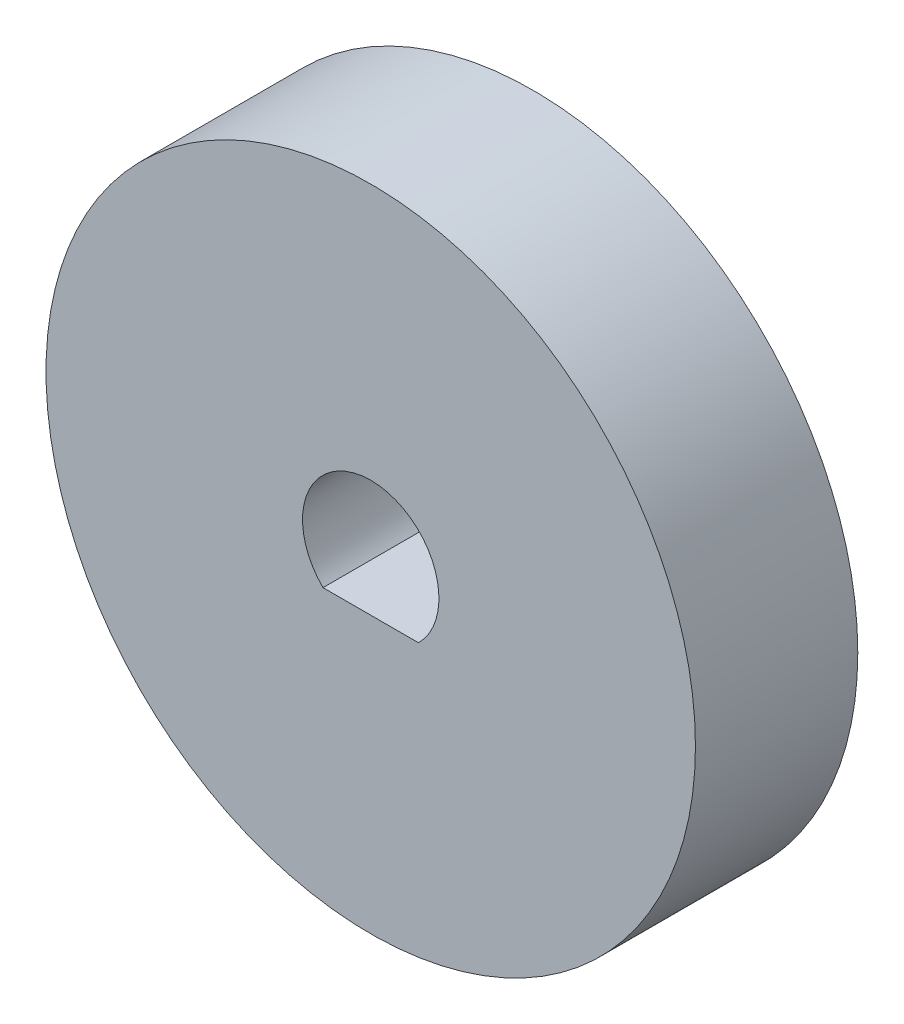
ISO-10303-21;
HEADER;
FILE_DESCRIPTION(('STEP AP214'),'2;1');
FILE_NAME('part.step','',(''),(''),'','','');
FILE_SCHEMA(('AUTOMOTIVE_DESIGN { 1 0 10303 214 1 1 1 1 }'));
ENDSEC;
DATA;
#1=APPLICATION_CONTEXT('core data for automotive mechanical design processes');
#2=APPLICATION_PROTOCOL_DEFINITION('international standard','automotive_design',2000,#1);
#3=PRODUCT_CONTEXT('',#1,'mechanical');
#4=PRODUCT('Part','Part','',(#3));
#5=PRODUCT_RELATED_PRODUCT_CATEGORY('part','',(#4));
#6=PRODUCT_DEFINITION_FORMATION('','',#4);
#7=PRODUCT_DEFINITION_CONTEXT('part definition',#1,'design');
#8=PRODUCT_DEFINITION('design','',#6,#7);
#9=PRODUCT_DEFINITION_SHAPE('','',#8);
#10=(LENGTH_UNIT() NAMED_UNIT(*) SI_UNIT(.MILLI.,.METRE.));
#11=(NAMED_UNIT(*) PLANE_ANGLE_UNIT() SI_UNIT($,.RADIAN.));
#12=(NAMED_UNIT(*) SI_UNIT($,.STERADIAN.) SOLID_ANGLE_UNIT());
#13=UNCERTAINTY_MEASURE_WITH_UNIT(LENGTH_MEASURE(1.E-05),#10,'distance_accuracy_value','');
#14=(GEOMETRIC_REPRESENTATION_CONTEXT(3) GLOBAL_UNCERTAINTY_ASSIGNED_CONTEXT((#13)) GLOBAL_UNIT_ASSIGNED_CONTEXT((#10,
#11,#12)) REPRESENTATION_CONTEXT('',''));
#15=CARTESIAN_POINT('',(0.,0.,0.));
#16=DIRECTION('',(0.,0.,1.));
#17=DIRECTION('',(1.,0.,0.));
#18=AXIS2_PLACEMENT_3D('',#15,#16,#17);
#19=CARTESIAN_POINT('',(0.,0.,5.));
#20=DIRECTION('',(0.,0.,-1.));
#21=DIRECTION('',(-1.,0.,0.));
#22=AXIS2_PLACEMENT_3D('',#19,#20,#21);
#23=CYLINDRICAL_SURFACE('',#22,10.);
#24=CARTESIAN_POINT('',(0.,0.,5.));
#25=DIRECTION('',(0.,0.,1.));
#26=DIRECTION('',(1.,0.,0.));
#27=AXIS2_PLACEMENT_3D('',#24,#25,#26);
#28=CIRCLE('',#27,10.);
#29=CARTESIAN_POINT('',(10.,0.,5.));
#30=VERTEX_POINT('',#29);
#31=EDGE_CURVE('E11',#30,#30,#28,.T.);
#32=ORIENTED_EDGE('',*,*,#31,.F.);
#33=EDGE_LOOP('',(#32));
#34=FACE_BOUND('',#33,.T.);
#35=CARTESIAN_POINT('',(0.,0.,0.));
#36=DIRECTION('',(0.,0.,1.));
#37=DIRECTION('',(1.,0.,0.));
#38=AXIS2_PLACEMENT_3D('',#35,#36,#37);
#39=CIRCLE('',#38,10.);
#40=CARTESIAN_POINT('',(10.,0.,0.));
#41=VERTEX_POINT('',#40);
#42=EDGE_CURVE('E36',#41,#41,#39,.T.);
#43=ORIENTED_EDGE('',*,*,#42,.T.);
#44=EDGE_LOOP('',(#43));
#45=FACE_BOUND('',#44,.T.);
#46=ADVANCED_FACE('F33',(#34,#45),#23,.T.);
#47=CARTESIAN_POINT('',(0.,0.,5.));
#48=DIRECTION('',(0.,0.,1.));
#49=DIRECTION('',(1.,0.,0.));
#50=AXIS2_PLACEMENT_3D('',#47,#48,#49);
#51=PLANE('',#50);
#52=CARTESIAN_POINT('',(0.,0.,5.));
#53=DIRECTION('',(0.,0.,1.));
#54=DIRECTION('',(1.,0.,0.));
#55=AXIS2_PLACEMENT_3D('',#52,#53,#54);
#56=CIRCLE('',#55,2.1);
#57=CARTESIAN_POINT('',(1.46969384566991,-1.5,5.));
#58=VERTEX_POINT('',#57);
#59=CARTESIAN_POINT('',(-1.46969384566991,-1.5,5.));
#60=VERTEX_POINT('',#59);
#61=EDGE_CURVE('E47',#58,#60,#56,.T.);
#62=ORIENTED_EDGE('',*,*,#61,.F.);
#63=DIRECTION('',(1.,0.,0.));
#64=VECTOR('',#63,1.);
#65=CARTESIAN_POINT('',(1.46969384566991,-1.5,5.));
#66=LINE('',#65,#64);
#67=EDGE_CURVE('E66',#60,#58,#66,.T.);
#68=ORIENTED_EDGE('',*,*,#67,.F.);
#69=EDGE_LOOP('',(#62,#68));
#70=FACE_BOUND('',#69,.T.);
#71=ORIENTED_EDGE('',*,*,#31,.T.);
#72=EDGE_LOOP('',(#71));
#73=FACE_BOUND('',#72,.T.);
#74=ADVANCED_FACE('F70',(#70,#73),#51,.T.);
#75=CARTESIAN_POINT('',(0.,0.,0.));
#76=DIRECTION('',(0.,0.,1.));
#77=DIRECTION('',(1.,0.,0.));
#78=AXIS2_PLACEMENT_3D('',#75,#76,#77);
#79=PLANE('',#78);
#80=DIRECTION('',(1.,0.,0.));
#81=VECTOR('',#80,1.);
#82=CARTESIAN_POINT('',(1.46969384566991,-1.5,0.));
#83=LINE('',#82,#81);
#84=CARTESIAN_POINT('',(-1.46969384566991,-1.5,0.));
#85=VERTEX_POINT('',#84);
#86=CARTESIAN_POINT('',(1.46969384566991,-1.5,0.));
#87=VERTEX_POINT('',#86);
#88=EDGE_CURVE('E74',#85,#87,#83,.T.);
#89=ORIENTED_EDGE('',*,*,#88,.T.);
#90=CARTESIAN_POINT('',(0.,0.,0.));
#91=DIRECTION('',(0.,0.,1.));
#92=DIRECTION('',(1.,0.,0.));
#93=AXIS2_PLACEMENT_3D('',#90,#91,#92);
#94=CIRCLE('',#93,2.1);
#95=EDGE_CURVE('E52',#87,#85,#94,.T.);
#96=ORIENTED_EDGE('',*,*,#95,.T.);
#97=EDGE_LOOP('',(#89,#96));
#98=FACE_BOUND('',#97,.T.);
#99=ORIENTED_EDGE('',*,*,#42,.F.);
#100=EDGE_LOOP('',(#99));
#101=FACE_BOUND('',#100,.T.);
#102=ADVANCED_FACE('F78',(#98,#101),#79,.F.);
#103=CARTESIAN_POINT('',(0.,0.,0.));
#104=DIRECTION('',(0.,0.,1.));
#105=DIRECTION('',(1.,0.,0.));
#106=AXIS2_PLACEMENT_3D('',#103,#104,#105);
#107=CYLINDRICAL_SURFACE('',#106,2.1);
#108=ORIENTED_EDGE('',*,*,#61,.T.);
#109=DIRECTION('',(0.,0.,1.));
#110=VECTOR('',#109,1.);
#111=CARTESIAN_POINT('',(-1.46969384566991,-1.5,0.));
#112=LINE('',#111,#110);
#113=EDGE_CURVE('E63',#85,#60,#112,.T.);
#114=ORIENTED_EDGE('',*,*,#113,.F.);
#115=ORIENTED_EDGE('',*,*,#95,.F.);
#116=DIRECTION('',(0.,0.,1.));
#117=VECTOR('',#116,1.);
#118=CARTESIAN_POINT('',(1.46969384566991,-1.5,0.));
#119=LINE('',#118,#117);
#120=EDGE_CURVE('E57',#87,#58,#119,.T.);
#121=ORIENTED_EDGE('',*,*,#120,.T.);
#122=EDGE_LOOP('',(#108,#114,#115,#121));
#123=FACE_BOUND('',#122,.T.);
#124=ADVANCED_FACE('F59',(#123),#107,.F.);
#125=CARTESIAN_POINT('',(1.46969384566991,-1.5,0.));
#126=DIRECTION('',(0.,-1.,0.));
#127=DIRECTION('',(0.,0.,-1.));
#128=AXIS2_PLACEMENT_3D('',#125,#126,#127);
#129=PLANE('',#128);
#130=ORIENTED_EDGE('',*,*,#67,.T.);
#131=ORIENTED_EDGE('',*,*,#120,.F.);
#132=ORIENTED_EDGE('',*,*,#88,.F.);
#133=ORIENTED_EDGE('',*,*,#113,.T.);
#134=EDGE_LOOP('',(#130,#131,#132,#133));
#135=FACE_BOUND('',#134,.T.);
#136=ADVANCED_FACE('F67',(#135),#129,.F.);
#137=CLOSED_SHELL('',(#46,#74,#102,#124,#136));
#138=MANIFOLD_SOLID_BREP('B2',#137);
#139=ADVANCED_BREP_SHAPE_REPRESENTATION('',(#18,#138),#14);
#140=SHAPE_DEFINITION_REPRESENTATION(#9,#139);
ENDSEC;
END-ISO-10303-21;
